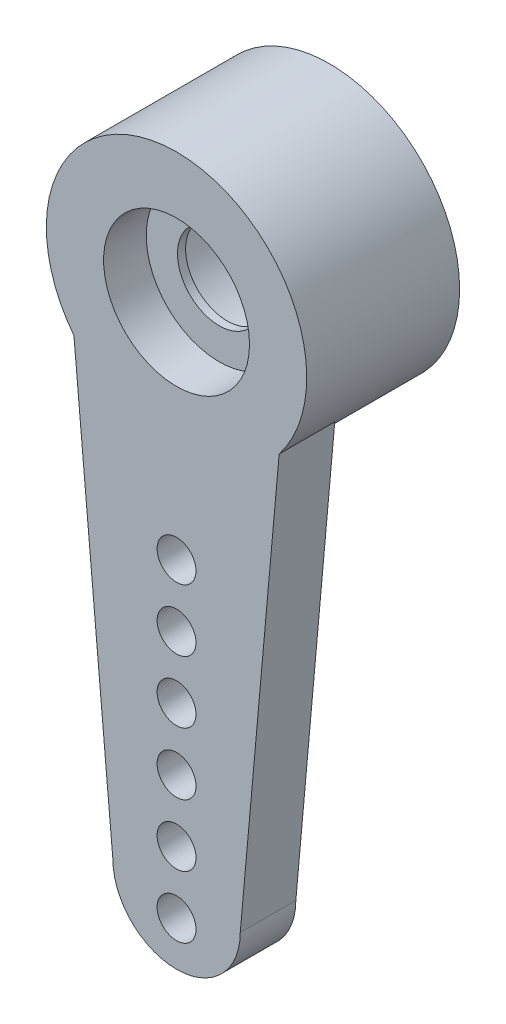
ISO-10303-21;
HEADER;
FILE_DESCRIPTION(('STEP AP214'),'2;1');
FILE_NAME('part.step','',(''),(''),'','','');
FILE_SCHEMA(('AUTOMOTIVE_DESIGN { 1 0 10303 214 1 1 1 1 }'));
ENDSEC;
DATA;
#1=APPLICATION_CONTEXT('core data for automotive mechanical design processes');
#2=APPLICATION_PROTOCOL_DEFINITION('international standard','automotive_design',2000,#1);
#3=PRODUCT_CONTEXT('',#1,'mechanical');
#4=PRODUCT('Part','Part','',(#3));
#5=PRODUCT_RELATED_PRODUCT_CATEGORY('part','',(#4));
#6=PRODUCT_DEFINITION_FORMATION('','',#4);
#7=PRODUCT_DEFINITION_CONTEXT('part definition',#1,'design');
#8=PRODUCT_DEFINITION('design','',#6,#7);
#9=PRODUCT_DEFINITION_SHAPE('','',#8);
#10=(LENGTH_UNIT() NAMED_UNIT(*) SI_UNIT(.MILLI.,.METRE.));
#11=(NAMED_UNIT(*) PLANE_ANGLE_UNIT() SI_UNIT($,.RADIAN.));
#12=(NAMED_UNIT(*) SI_UNIT($,.STERADIAN.) SOLID_ANGLE_UNIT());
#13=UNCERTAINTY_MEASURE_WITH_UNIT(LENGTH_MEASURE(1.E-05),#10,'distance_accuracy_value','');
#14=(GEOMETRIC_REPRESENTATION_CONTEXT(3) GLOBAL_UNCERTAINTY_ASSIGNED_CONTEXT((#13)) GLOBAL_UNIT_ASSIGNED_CONTEXT((#10,
#11,#12)) REPRESENTATION_CONTEXT('',''));
#15=CARTESIAN_POINT('',(0.,0.,0.));
#16=DIRECTION('',(0.,0.,1.));
#17=DIRECTION('',(1.,0.,0.));
#18=AXIS2_PLACEMENT_3D('',#15,#16,#17);
#19=CARTESIAN_POINT('',(-5.49999999999997,0.,-2.84196586235089));
#20=DIRECTION('',(0.,0.,-1.));
#21=DIRECTION('',(-1.,0.,0.));
#22=AXIS2_PLACEMENT_3D('',#19,#20,#21);
#23=CYLINDRICAL_SURFACE('',#22,2.);
#24=CARTESIAN_POINT('',(-5.49999999999997,0.,-7.03296586235089));
#25=DIRECTION('',(0.,0.,1.));
#26=DIRECTION('',(1.,0.,0.));
#27=AXIS2_PLACEMENT_3D('',#24,#25,#26);
#28=CIRCLE('',#27,2.);
#29=CARTESIAN_POINT('',(-3.49999999999996,0.,-7.03296586235089));
#30=VERTEX_POINT('',#29);
#31=EDGE_CURVE('E113',#30,#30,#28,.T.);
#32=ORIENTED_EDGE('',*,*,#31,.F.);
#33=EDGE_LOOP('',(#32));
#34=FACE_BOUND('',#33,.T.);
#35=CARTESIAN_POINT('',(-5.49999999999997,0.,-4.23296586235089));
#36=DIRECTION('',(0.,0.,1.));
#37=DIRECTION('',(1.,0.,0.));
#38=AXIS2_PLACEMENT_3D('',#35,#36,#37);
#39=CIRCLE('',#38,2.00000000000001);
#40=CARTESIAN_POINT('',(-3.49999999999996,0.,-4.23296586235089));
#41=VERTEX_POINT('',#40);
#42=EDGE_CURVE('E109',#41,#41,#39,.T.);
#43=ORIENTED_EDGE('',*,*,#42,.T.);
#44=EDGE_LOOP('',(#43));
#45=FACE_BOUND('',#44,.T.);
#46=ADVANCED_FACE('F36',(#34,#45),#23,.F.);
#47=CARTESIAN_POINT('',(-5.49999999999997,0.,-2.84196586235089));
#48=DIRECTION('',(0.,0.,1.));
#49=DIRECTION('',(1.,0.,0.));
#50=AXIS2_PLACEMENT_3D('',#47,#48,#49);
#51=PLANE('',#50);
#52=CARTESIAN_POINT('',(-5.49999999999997,0.,-2.84196586235089));
#53=DIRECTION('',(0.,0.,1.));
#54=DIRECTION('',(1.,0.,0.));
#55=AXIS2_PLACEMENT_3D('',#52,#53,#54);
#56=CIRCLE('',#55,3.5687);
#57=CARTESIAN_POINT('',(-2.68694999999995,-2.19598938692788,-2.84196586235089));
#58=VERTEX_POINT('',#57);
#59=CARTESIAN_POINT('',(-8.31304999999995,-2.1959893869279,-2.84196586235089));
#60=VERTEX_POINT('',#59);
#61=EDGE_CURVE('E44',#58,#60,#56,.T.);
#62=ORIENTED_EDGE('',*,*,#61,.T.);
#63=DIRECTION('',(0.0893287482023586,-0.996002196154506,0.));
#64=VECTOR('',#63,1.);
#65=CARTESIAN_POINT('',(-7.24624999999995,-14.09065,-2.84196586235089));
#66=LINE('',#65,#64);
#67=CARTESIAN_POINT('',(-7.24624999999995,-14.09065,-2.84196586235089));
#68=VERTEX_POINT('',#67);
#69=EDGE_CURVE('E197',#60,#68,#66,.T.);
#70=ORIENTED_EDGE('',*,*,#69,.T.);
#71=CARTESIAN_POINT('',(-5.49999999999995,-14.09065,-2.84196586235089));
#72=DIRECTION('',(0.,0.,1.));
#73=DIRECTION('',(1.,0.,0.));
#74=AXIS2_PLACEMENT_3D('',#71,#72,#73);
#75=CIRCLE('',#74,1.74625);
#76=CARTESIAN_POINT('',(-3.75374999999995,-14.09065,-2.84196586235089));
#77=VERTEX_POINT('',#76);
#78=EDGE_CURVE('E191',#68,#77,#75,.T.);
#79=ORIENTED_EDGE('',*,*,#78,.T.);
#80=DIRECTION('',(0.0893287482023584,0.996002196154506,0.));
#81=VECTOR('',#80,1.);
#82=CARTESIAN_POINT('',(-3.75374999999995,-14.09065,-2.84196586235089));
#83=LINE('',#82,#81);
#84=EDGE_CURVE('E51',#77,#58,#83,.T.);
#85=ORIENTED_EDGE('',*,*,#84,.T.);
#86=EDGE_LOOP('',(#62,#70,#79,#85));
#87=FACE_BOUND('',#86,.T.);
#88=CARTESIAN_POINT('',(-5.49999999999997,0.,-2.84196586235089));
#89=DIRECTION('',(0.,0.,1.));
#90=DIRECTION('',(1.,0.,0.));
#91=AXIS2_PLACEMENT_3D('',#88,#89,#90);
#92=CIRCLE('',#91,2.);
#93=CARTESIAN_POINT('',(-3.49999999999996,0.,-2.84196586235089));
#94=VERTEX_POINT('',#93);
#95=EDGE_CURVE('E116',#94,#94,#92,.T.);
#96=ORIENTED_EDGE('',*,*,#95,.F.);
#97=EDGE_LOOP('',(#96));
#98=FACE_BOUND('',#97,.T.);
#99=CARTESIAN_POINT('',(-5.49999999999998,-6.11505,-2.84196586235089));
#100=DIRECTION('',(0.,0.,1.));
#101=DIRECTION('',(1.,0.,0.));
#102=AXIS2_PLACEMENT_3D('',#99,#100,#101);
#103=CIRCLE('',#102,0.533399999999999);
#104=CARTESIAN_POINT('',(-4.96659999999998,-6.11505,-2.84196586235089));
#105=VERTEX_POINT('',#104);
#106=EDGE_CURVE('E166',#105,#105,#103,.T.);
#107=ORIENTED_EDGE('',*,*,#106,.F.);
#108=EDGE_LOOP('',(#107));
#109=FACE_BOUND('',#108,.T.);
#110=CARTESIAN_POINT('',(-5.49999999999997,-7.81685,-2.84196586235089));
#111=DIRECTION('',(0.,0.,1.));
#112=DIRECTION('',(1.,0.,0.));
#113=AXIS2_PLACEMENT_3D('',#110,#111,#112);
#114=CIRCLE('',#113,0.533399999999999);
#115=CARTESIAN_POINT('',(-4.96659999999998,-7.81685,-2.84196586235089));
#116=VERTEX_POINT('',#115);
#117=EDGE_CURVE('E170',#116,#116,#114,.T.);
#118=ORIENTED_EDGE('',*,*,#117,.F.);
#119=EDGE_LOOP('',(#118));
#120=FACE_BOUND('',#119,.T.);
#121=CARTESIAN_POINT('',(-5.49999999999997,-9.51865,-2.84196586235089));
#122=DIRECTION('',(0.,0.,1.));
#123=DIRECTION('',(1.,0.,0.));
#124=AXIS2_PLACEMENT_3D('',#121,#122,#123);
#125=CIRCLE('',#124,0.5334);
#126=CARTESIAN_POINT('',(-4.96659999999997,-9.51865,-2.84196586235089));
#127=VERTEX_POINT('',#126);
#128=EDGE_CURVE('E174',#127,#127,#125,.T.);
#129=ORIENTED_EDGE('',*,*,#128,.F.);
#130=EDGE_LOOP('',(#129));
#131=FACE_BOUND('',#130,.T.);
#132=CARTESIAN_POINT('',(-5.49999999999996,-11.22045,-2.84196586235089));
#133=DIRECTION('',(0.,0.,1.));
#134=DIRECTION('',(1.,0.,0.));
#135=AXIS2_PLACEMENT_3D('',#132,#133,#134);
#136=CIRCLE('',#135,0.5334);
#137=CARTESIAN_POINT('',(-4.96659999999996,-11.22045,-2.84196586235089));
#138=VERTEX_POINT('',#137);
#139=EDGE_CURVE('E178',#138,#138,#136,.T.);
#140=ORIENTED_EDGE('',*,*,#139,.F.);
#141=EDGE_LOOP('',(#140));
#142=FACE_BOUND('',#141,.T.);
#143=CARTESIAN_POINT('',(-5.49999999999996,-12.92225,-2.84196586235089));
#144=DIRECTION('',(0.,0.,1.));
#145=DIRECTION('',(1.,0.,0.));
#146=AXIS2_PLACEMENT_3D('',#143,#144,#145);
#147=CIRCLE('',#146,0.5334);
#148=CARTESIAN_POINT('',(-4.96659999999996,-12.92225,-2.84196586235089));
#149=VERTEX_POINT('',#148);
#150=EDGE_CURVE('E182',#149,#149,#147,.T.);
#151=ORIENTED_EDGE('',*,*,#150,.F.);
#152=EDGE_LOOP('',(#151));
#153=FACE_BOUND('',#152,.T.);
#154=CARTESIAN_POINT('',(-5.49999999999995,-14.62405,-2.84196586235089));
#155=DIRECTION('',(0.,0.,1.));
#156=DIRECTION('',(1.,0.,0.));
#157=AXIS2_PLACEMENT_3D('',#154,#155,#156);
#158=CIRCLE('',#157,0.5334);
#159=CARTESIAN_POINT('',(-4.96659999999995,-14.62405,-2.84196586235089));
#160=VERTEX_POINT('',#159);
#161=EDGE_CURVE('E185',#160,#160,#158,.T.);
#162=ORIENTED_EDGE('',*,*,#161,.F.);
#163=EDGE_LOOP('',(#162));
#164=FACE_BOUND('',#163,.T.);
#165=ADVANCED_FACE('F128',(#87,#98,#109,#120,#131,#142,#153,#164),#51,.T.);
#166=CARTESIAN_POINT('',(-5.49999999999997,0.,-7.03296586235089));
#167=DIRECTION('',(0.,0.,1.));
#168=DIRECTION('',(1.,0.,0.));
#169=AXIS2_PLACEMENT_3D('',#166,#167,#168);
#170=PLANE('',#169);
#171=CARTESIAN_POINT('',(-5.49999999999997,0.,-7.03296586235089));
#172=DIRECTION('',(0.,0.,1.));
#173=DIRECTION('',(1.,0.,0.));
#174=AXIS2_PLACEMENT_3D('',#171,#172,#173);
#175=CIRCLE('',#174,3.5687);
#176=CARTESIAN_POINT('',(-1.93129999999997,0.,-7.03296586235089));
#177=VERTEX_POINT('',#176);
#178=EDGE_CURVE('E119',#177,#177,#175,.T.);
#179=ORIENTED_EDGE('',*,*,#178,.F.);
#180=EDGE_LOOP('',(#179));
#181=FACE_BOUND('',#180,.T.);
#182=ORIENTED_EDGE('',*,*,#31,.T.);
#183=EDGE_LOOP('',(#182));
#184=FACE_BOUND('',#183,.T.);
#185=ADVANCED_FACE('F125',(#181,#184),#170,.F.);
#186=CARTESIAN_POINT('',(-5.49999999999997,0.,-2.84196586235089));
#187=DIRECTION('',(0.,0.,-1.));
#188=DIRECTION('',(-1.,0.,0.));
#189=AXIS2_PLACEMENT_3D('',#186,#187,#188);
#190=CYLINDRICAL_SURFACE('',#189,3.5687);
#191=CARTESIAN_POINT('',(-5.49999999999995,0.,-4.36596586235089));
#192=DIRECTION('',(0.,0.,-1.));
#193=DIRECTION('',(-1.,0.,0.));
#194=AXIS2_PLACEMENT_3D('',#191,#192,#193);
#195=CIRCLE('',#194,3.5687);
#196=CARTESIAN_POINT('',(-2.68694999999995,-2.1959893869279,-4.36596586235089));
#197=VERTEX_POINT('',#196);
#198=CARTESIAN_POINT('',(-8.31304999999995,-2.1959893869279,-4.36596586235089));
#199=VERTEX_POINT('',#198);
#200=EDGE_CURVE('E86',#197,#199,#195,.T.);
#201=ORIENTED_EDGE('',*,*,#200,.T.);
#202=DIRECTION('',(0.,0.,1.));
#203=VECTOR('',#202,1.);
#204=CARTESIAN_POINT('',(-8.31304999999995,-2.1959893869279,-4.36596586235089));
#205=LINE('',#204,#203);
#206=EDGE_CURVE('E100',#199,#60,#205,.T.);
#207=ORIENTED_EDGE('',*,*,#206,.T.);
#208=ORIENTED_EDGE('',*,*,#61,.F.);
#209=DIRECTION('',(0.,0.,1.));
#210=VECTOR('',#209,1.);
#211=CARTESIAN_POINT('',(-2.68694999999995,-2.1959893869279,-4.36596586235089));
#212=LINE('',#211,#210);
#213=EDGE_CURVE('E95',#197,#58,#212,.T.);
#214=ORIENTED_EDGE('',*,*,#213,.F.);
#215=EDGE_LOOP('',(#201,#207,#208,#214));
#216=FACE_BOUND('',#215,.T.);
#217=ORIENTED_EDGE('',*,*,#178,.T.);
#218=EDGE_LOOP('',(#217));
#219=FACE_BOUND('',#218,.T.);
#220=ADVANCED_FACE('F38',(#216,#219),#190,.T.);
#221=CARTESIAN_POINT('',(-5.49999999999997,0.,-4.01036586235089));
#222=DIRECTION('',(0.,0.,1.));
#223=DIRECTION('',(1.,0.,0.));
#224=AXIS2_PLACEMENT_3D('',#221,#222,#223);
#225=CIRCLE('',#224,2.);
#226=CARTESIAN_POINT('',(-3.49999999999996,0.,-4.01036586235089));
#227=VERTEX_POINT('',#226);
#228=EDGE_CURVE('E12',#227,#227,#225,.T.);
#229=ORIENTED_EDGE('',*,*,#228,.F.);
#230=EDGE_LOOP('',(#229));
#231=FACE_BOUND('',#230,.T.);
#232=ORIENTED_EDGE('',*,*,#95,.T.);
#233=EDGE_LOOP('',(#232));
#234=FACE_BOUND('',#233,.T.);
#235=ADVANCED_FACE('F134',(#231,#234),#23,.F.);
#236=CARTESIAN_POINT('',(-5.49999999999997,0.,-4.23296586235089));
#237=DIRECTION('',(0.,0.,1.));
#238=DIRECTION('',(1.,0.,0.));
#239=AXIS2_PLACEMENT_3D('',#236,#237,#238);
#240=PLANE('',#239);
#241=ORIENTED_EDGE('',*,*,#42,.F.);
#242=EDGE_LOOP('',(#241));
#243=FACE_BOUND('',#242,.T.);
#244=CARTESIAN_POINT('',(-5.49999999999997,0.,-4.23296586235089));
#245=DIRECTION('',(0.,0.,1.));
#246=DIRECTION('',(1.,0.,0.));
#247=AXIS2_PLACEMENT_3D('',#244,#245,#246);
#248=CIRCLE('',#247,1.14300000000001);
#249=CARTESIAN_POINT('',(-4.35699999999996,0.,-4.23296586235089));
#250=VERTEX_POINT('',#249);
#251=EDGE_CURVE('E106',#250,#250,#248,.T.);
#252=ORIENTED_EDGE('',*,*,#251,.T.);
#253=EDGE_LOOP('',(#252));
#254=FACE_BOUND('',#253,.T.);
#255=ADVANCED_FACE('F137',(#243,#254),#240,.F.);
#256=CARTESIAN_POINT('',(-5.49999999999997,0.,2.81488838714151));
#257=DIRECTION('',(0.,0.,-1.));
#258=DIRECTION('',(-1.,0.,0.));
#259=AXIS2_PLACEMENT_3D('',#256,#257,#258);
#260=CYLINDRICAL_SURFACE('',#259,1.14300000000001);
#261=ORIENTED_EDGE('',*,*,#251,.F.);
#262=EDGE_LOOP('',(#261));
#263=FACE_BOUND('',#262,.T.);
#264=CARTESIAN_POINT('',(-5.49999999999997,0.,-4.01036586235089));
#265=DIRECTION('',(0.,0.,1.));
#266=DIRECTION('',(1.,0.,0.));
#267=AXIS2_PLACEMENT_3D('',#264,#265,#266);
#268=CIRCLE('',#267,1.14300000000001);
#269=CARTESIAN_POINT('',(-4.35699999999996,0.,-4.01036586235089));
#270=VERTEX_POINT('',#269);
#271=EDGE_CURVE('E110',#270,#270,#268,.T.);
#272=ORIENTED_EDGE('',*,*,#271,.T.);
#273=EDGE_LOOP('',(#272));
#274=FACE_BOUND('',#273,.T.);
#275=ADVANCED_FACE('F140',(#263,#274),#260,.F.);
#276=CARTESIAN_POINT('',(-5.49999999999997,0.,-4.01036586235089));
#277=DIRECTION('',(0.,0.,1.));
#278=DIRECTION('',(1.,0.,0.));
#279=AXIS2_PLACEMENT_3D('',#276,#277,#278);
#280=PLANE('',#279);
#281=ORIENTED_EDGE('',*,*,#271,.F.);
#282=EDGE_LOOP('',(#281));
#283=FACE_BOUND('',#282,.T.);
#284=ORIENTED_EDGE('',*,*,#228,.T.);
#285=EDGE_LOOP('',(#284));
#286=FACE_BOUND('',#285,.T.);
#287=ADVANCED_FACE('F146',(#283,#286),#280,.T.);
#288=CARTESIAN_POINT('',(-5.49999999999995,-14.09065,-4.36596586235089));
#289=DIRECTION('',(0.,0.,1.));
#290=DIRECTION('',(1.,0.,0.));
#291=AXIS2_PLACEMENT_3D('',#288,#289,#290);
#292=CYLINDRICAL_SURFACE('',#291,1.74625);
#293=ORIENTED_EDGE('',*,*,#78,.F.);
#294=DIRECTION('',(0.,0.,1.));
#295=VECTOR('',#294,1.);
#296=CARTESIAN_POINT('',(-7.24624999999995,-14.09065,-4.36596586235089));
#297=LINE('',#296,#295);
#298=CARTESIAN_POINT('',(-7.24624999999995,-14.09065,-4.36596586235089));
#299=VERTEX_POINT('',#298);
#300=EDGE_CURVE('E60',#299,#68,#297,.T.);
#301=ORIENTED_EDGE('',*,*,#300,.F.);
#302=CARTESIAN_POINT('',(-5.49999999999995,-14.09065,-4.36596586235089));
#303=DIRECTION('',(0.,0.,1.));
#304=DIRECTION('',(1.,0.,0.));
#305=AXIS2_PLACEMENT_3D('',#302,#303,#304);
#306=CIRCLE('',#305,1.74625);
#307=CARTESIAN_POINT('',(-3.75374999999995,-14.09065,-4.36596586235089));
#308=VERTEX_POINT('',#307);
#309=EDGE_CURVE('E97',#299,#308,#306,.T.);
#310=ORIENTED_EDGE('',*,*,#309,.T.);
#311=DIRECTION('',(0.,0.,1.));
#312=VECTOR('',#311,1.);
#313=CARTESIAN_POINT('',(-3.75374999999995,-14.09065,-4.36596586235089));
#314=LINE('',#313,#312);
#315=EDGE_CURVE('E80',#308,#77,#314,.T.);
#316=ORIENTED_EDGE('',*,*,#315,.T.);
#317=EDGE_LOOP('',(#293,#301,#310,#316));
#318=FACE_BOUND('',#317,.T.);
#319=ADVANCED_FACE('F152',(#318),#292,.T.);
#320=CARTESIAN_POINT('',(-7.24624999999995,-14.09065,-4.36596586235089));
#321=DIRECTION('',(-0.996002196154506,-0.0893287482023586,0.));
#322=DIRECTION('',(0.0893287482023586,-0.996002196154506,0.));
#323=AXIS2_PLACEMENT_3D('',#320,#321,#322);
#324=PLANE('',#323);
#325=ORIENTED_EDGE('',*,*,#69,.F.);
#326=ORIENTED_EDGE('',*,*,#206,.F.);
#327=DIRECTION('',(0.0893287482023586,-0.996002196154506,0.));
#328=VECTOR('',#327,1.);
#329=CARTESIAN_POINT('',(-7.24624999999995,-14.09065,-4.36596586235089));
#330=LINE('',#329,#328);
#331=EDGE_CURVE('E89',#199,#299,#330,.T.);
#332=ORIENTED_EDGE('',*,*,#331,.T.);
#333=ORIENTED_EDGE('',*,*,#300,.T.);
#334=EDGE_LOOP('',(#325,#326,#332,#333));
#335=FACE_BOUND('',#334,.T.);
#336=ADVANCED_FACE('F203',(#335),#324,.T.);
#337=CARTESIAN_POINT('',(-3.75374999999995,-14.09065,-4.36596586235089));
#338=DIRECTION('',(0.996002196154506,-0.0893287482023584,0.));
#339=DIRECTION('',(0.0893287482023584,0.996002196154506,0.));
#340=AXIS2_PLACEMENT_3D('',#337,#338,#339);
#341=PLANE('',#340);
#342=ORIENTED_EDGE('',*,*,#84,.F.);
#343=ORIENTED_EDGE('',*,*,#315,.F.);
#344=DIRECTION('',(0.0893287482023584,0.996002196154506,0.));
#345=VECTOR('',#344,1.);
#346=CARTESIAN_POINT('',(-3.75374999999995,-14.09065,-4.36596586235089));
#347=LINE('',#346,#345);
#348=EDGE_CURVE('E88',#308,#197,#347,.T.);
#349=ORIENTED_EDGE('',*,*,#348,.T.);
#350=ORIENTED_EDGE('',*,*,#213,.T.);
#351=EDGE_LOOP('',(#342,#343,#349,#350));
#352=FACE_BOUND('',#351,.T.);
#353=ADVANCED_FACE('F94',(#352),#341,.T.);
#354=CARTESIAN_POINT('',(-5.49999999999995,-14.09065,-4.36596586235089));
#355=DIRECTION('',(0.,0.,1.));
#356=DIRECTION('',(1.,0.,0.));
#357=AXIS2_PLACEMENT_3D('',#354,#355,#356);
#358=PLANE('',#357);
#359=CARTESIAN_POINT('',(-5.49999999999998,-6.11505,-4.36596586235089));
#360=DIRECTION('',(0.,0.,1.));
#361=DIRECTION('',(1.,0.,0.));
#362=AXIS2_PLACEMENT_3D('',#359,#360,#361);
#363=CIRCLE('',#362,0.533399999999999);
#364=CARTESIAN_POINT('',(-4.96659999999998,-6.11505,-4.36596586235089));
#365=VERTEX_POINT('',#364);
#366=EDGE_CURVE('E244',#365,#365,#363,.T.);
#367=ORIENTED_EDGE('',*,*,#366,.T.);
#368=EDGE_LOOP('',(#367));
#369=FACE_BOUND('',#368,.T.);
#370=CARTESIAN_POINT('',(-5.49999999999997,-7.81685,-4.36596586235089));
#371=DIRECTION('',(0.,0.,1.));
#372=DIRECTION('',(1.,0.,0.));
#373=AXIS2_PLACEMENT_3D('',#370,#371,#372);
#374=CIRCLE('',#373,0.533399999999999);
#375=CARTESIAN_POINT('',(-4.96659999999998,-7.81685,-4.36596586235089));
#376=VERTEX_POINT('',#375);
#377=EDGE_CURVE('E248',#376,#376,#374,.T.);
#378=ORIENTED_EDGE('',*,*,#377,.T.);
#379=EDGE_LOOP('',(#378));
#380=FACE_BOUND('',#379,.T.);
#381=CARTESIAN_POINT('',(-5.49999999999997,-9.51865,-4.36596586235089));
#382=DIRECTION('',(0.,0.,1.));
#383=DIRECTION('',(1.,0.,0.));
#384=AXIS2_PLACEMENT_3D('',#381,#382,#383);
#385=CIRCLE('',#384,0.5334);
#386=CARTESIAN_POINT('',(-4.96659999999997,-9.51865,-4.36596586235089));
#387=VERTEX_POINT('',#386);
#388=EDGE_CURVE('E252',#387,#387,#385,.T.);
#389=ORIENTED_EDGE('',*,*,#388,.T.);
#390=EDGE_LOOP('',(#389));
#391=FACE_BOUND('',#390,.T.);
#392=CARTESIAN_POINT('',(-5.49999999999996,-11.22045,-4.36596586235089));
#393=DIRECTION('',(0.,0.,1.));
#394=DIRECTION('',(1.,0.,0.));
#395=AXIS2_PLACEMENT_3D('',#392,#393,#394);
#396=CIRCLE('',#395,0.5334);
#397=CARTESIAN_POINT('',(-4.96659999999996,-11.22045,-4.36596586235089));
#398=VERTEX_POINT('',#397);
#399=EDGE_CURVE('E256',#398,#398,#396,.T.);
#400=ORIENTED_EDGE('',*,*,#399,.T.);
#401=EDGE_LOOP('',(#400));
#402=FACE_BOUND('',#401,.T.);
#403=CARTESIAN_POINT('',(-5.49999999999996,-12.92225,-4.36596586235089));
#404=DIRECTION('',(0.,0.,1.));
#405=DIRECTION('',(1.,0.,0.));
#406=AXIS2_PLACEMENT_3D('',#403,#404,#405);
#407=CIRCLE('',#406,0.5334);
#408=CARTESIAN_POINT('',(-4.96659999999996,-12.92225,-4.36596586235089));
#409=VERTEX_POINT('',#408);
#410=EDGE_CURVE('E188',#409,#409,#407,.T.);
#411=ORIENTED_EDGE('',*,*,#410,.T.);
#412=EDGE_LOOP('',(#411));
#413=FACE_BOUND('',#412,.T.);
#414=CARTESIAN_POINT('',(-5.49999999999995,-14.62405,-4.36596586235089));
#415=DIRECTION('',(0.,0.,1.));
#416=DIRECTION('',(1.,0.,0.));
#417=AXIS2_PLACEMENT_3D('',#414,#415,#416);
#418=CIRCLE('',#417,0.5334);
#419=CARTESIAN_POINT('',(-4.96659999999995,-14.62405,-4.36596586235089));
#420=VERTEX_POINT('',#419);
#421=EDGE_CURVE('E187',#420,#420,#418,.T.);
#422=ORIENTED_EDGE('',*,*,#421,.T.);
#423=EDGE_LOOP('',(#422));
#424=FACE_BOUND('',#423,.T.);
#425=ORIENTED_EDGE('',*,*,#309,.F.);
#426=ORIENTED_EDGE('',*,*,#331,.F.);
#427=ORIENTED_EDGE('',*,*,#200,.F.);
#428=ORIENTED_EDGE('',*,*,#348,.F.);
#429=EDGE_LOOP('',(#425,#426,#427,#428));
#430=FACE_BOUND('',#429,.T.);
#431=ADVANCED_FACE('F87',(#369,#380,#391,#402,#413,#424,#430),#358,.F.);
#432=CARTESIAN_POINT('',(-5.49999999999995,-14.62405,-4.36596586235089));
#433=DIRECTION('',(0.,0.,1.));
#434=DIRECTION('',(1.,0.,0.));
#435=AXIS2_PLACEMENT_3D('',#432,#433,#434);
#436=CYLINDRICAL_SURFACE('',#435,0.5334);
#437=ORIENTED_EDGE('',*,*,#421,.F.);
#438=EDGE_LOOP('',(#437));
#439=FACE_BOUND('',#438,.T.);
#440=ORIENTED_EDGE('',*,*,#161,.T.);
#441=EDGE_LOOP('',(#440));
#442=FACE_BOUND('',#441,.T.);
#443=ADVANCED_FACE('F215',(#439,#442),#436,.F.);
#444=CARTESIAN_POINT('',(-5.49999999999996,-12.92225,-4.36596586235089));
#445=DIRECTION('',(0.,0.,1.));
#446=DIRECTION('',(1.,0.,0.));
#447=AXIS2_PLACEMENT_3D('',#444,#445,#446);
#448=CYLINDRICAL_SURFACE('',#447,0.5334);
#449=ORIENTED_EDGE('',*,*,#410,.F.);
#450=EDGE_LOOP('',(#449));
#451=FACE_BOUND('',#450,.T.);
#452=ORIENTED_EDGE('',*,*,#150,.T.);
#453=EDGE_LOOP('',(#452));
#454=FACE_BOUND('',#453,.T.);
#455=ADVANCED_FACE('F219',(#451,#454),#448,.F.);
#456=CARTESIAN_POINT('',(-5.49999999999996,-11.22045,-4.36596586235089));
#457=DIRECTION('',(0.,0.,1.));
#458=DIRECTION('',(1.,0.,0.));
#459=AXIS2_PLACEMENT_3D('',#456,#457,#458);
#460=CYLINDRICAL_SURFACE('',#459,0.5334);
#461=ORIENTED_EDGE('',*,*,#399,.F.);
#462=EDGE_LOOP('',(#461));
#463=FACE_BOUND('',#462,.T.);
#464=ORIENTED_EDGE('',*,*,#139,.T.);
#465=EDGE_LOOP('',(#464));
#466=FACE_BOUND('',#465,.T.);
#467=ADVANCED_FACE('F223',(#463,#466),#460,.F.);
#468=CARTESIAN_POINT('',(-5.49999999999997,-9.51865,-4.36596586235089));
#469=DIRECTION('',(0.,0.,1.));
#470=DIRECTION('',(1.,0.,0.));
#471=AXIS2_PLACEMENT_3D('',#468,#469,#470);
#472=CYLINDRICAL_SURFACE('',#471,0.5334);
#473=ORIENTED_EDGE('',*,*,#388,.F.);
#474=EDGE_LOOP('',(#473));
#475=FACE_BOUND('',#474,.T.);
#476=ORIENTED_EDGE('',*,*,#128,.T.);
#477=EDGE_LOOP('',(#476));
#478=FACE_BOUND('',#477,.T.);
#479=ADVANCED_FACE('F227',(#475,#478),#472,.F.);
#480=CARTESIAN_POINT('',(-5.49999999999997,-7.81685,-4.36596586235089));
#481=DIRECTION('',(0.,0.,1.));
#482=DIRECTION('',(1.,0.,0.));
#483=AXIS2_PLACEMENT_3D('',#480,#481,#482);
#484=CYLINDRICAL_SURFACE('',#483,0.533399999999999);
#485=ORIENTED_EDGE('',*,*,#377,.F.);
#486=EDGE_LOOP('',(#485));
#487=FACE_BOUND('',#486,.T.);
#488=ORIENTED_EDGE('',*,*,#117,.T.);
#489=EDGE_LOOP('',(#488));
#490=FACE_BOUND('',#489,.T.);
#491=ADVANCED_FACE('F231',(#487,#490),#484,.F.);
#492=CARTESIAN_POINT('',(-5.49999999999998,-6.11505,-4.36596586235089));
#493=DIRECTION('',(0.,0.,1.));
#494=DIRECTION('',(1.,0.,0.));
#495=AXIS2_PLACEMENT_3D('',#492,#493,#494);
#496=CYLINDRICAL_SURFACE('',#495,0.533399999999999);
#497=ORIENTED_EDGE('',*,*,#366,.F.);
#498=EDGE_LOOP('',(#497));
#499=FACE_BOUND('',#498,.T.);
#500=ORIENTED_EDGE('',*,*,#106,.T.);
#501=EDGE_LOOP('',(#500));
#502=FACE_BOUND('',#501,.T.);
#503=ADVANCED_FACE('F235',(#499,#502),#496,.F.);
#504=CLOSED_SHELL('',(#46,#165,#185,#220,#235,#255,#275,#287,#319,#336,#353,#431,#443,#455,#467,
#479,#491,#503));
#505=MANIFOLD_SOLID_BREP('B2',#504);
#506=ADVANCED_BREP_SHAPE_REPRESENTATION('',(#18,#505),#14);
#507=SHAPE_DEFINITION_REPRESENTATION(#9,#506);
ENDSEC;
END-ISO-10303-21;
